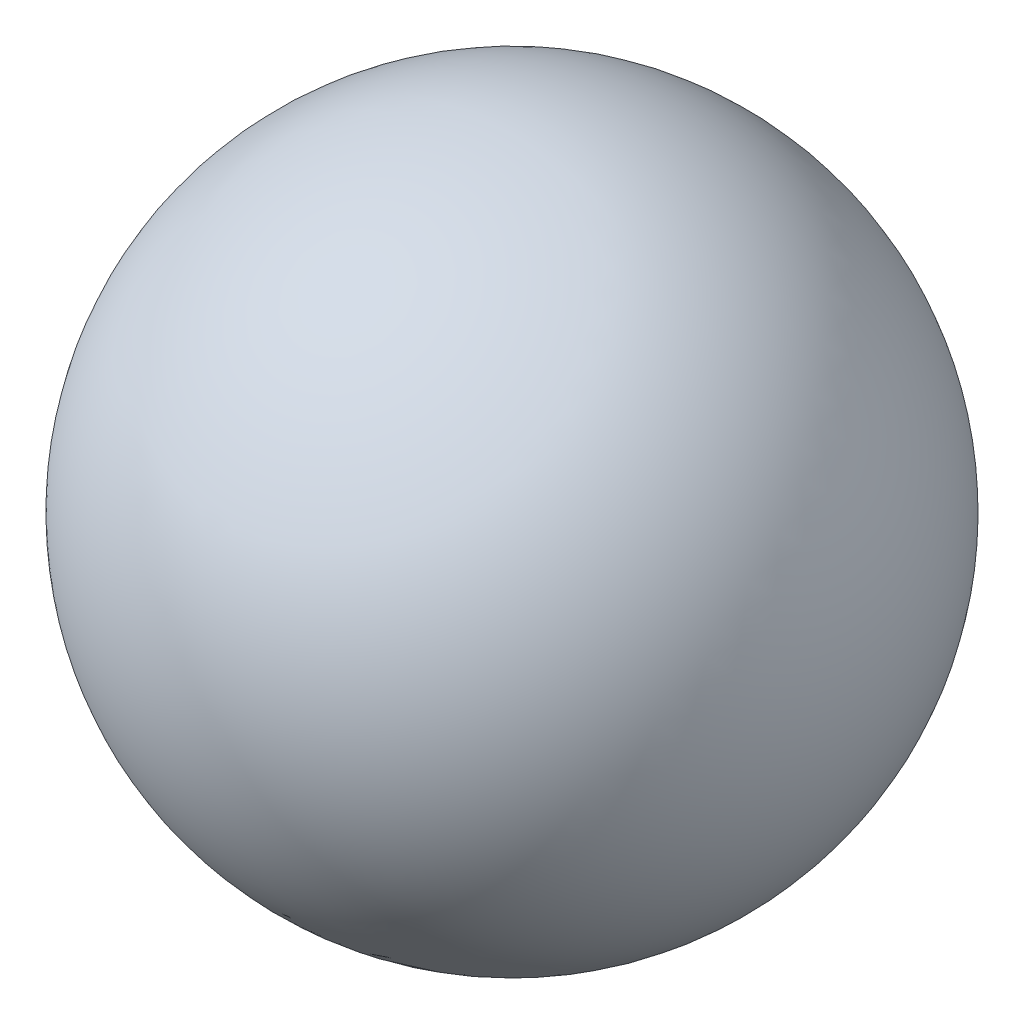
ISO-10303-21;
HEADER;
FILE_DESCRIPTION(('STEP AP214'),'2;1');
FILE_NAME('part.step','',(''),(''),'','','');
FILE_SCHEMA(('AUTOMOTIVE_DESIGN { 1 0 10303 214 1 1 1 1 }'));
ENDSEC;
DATA;
#1=APPLICATION_CONTEXT('core data for automotive mechanical design processes');
#2=APPLICATION_PROTOCOL_DEFINITION('international standard','automotive_design',2000,#1);
#3=PRODUCT_CONTEXT('',#1,'mechanical');
#4=PRODUCT('Part','Part','',(#3));
#5=PRODUCT_RELATED_PRODUCT_CATEGORY('part','',(#4));
#6=PRODUCT_DEFINITION_FORMATION('','',#4);
#7=PRODUCT_DEFINITION_CONTEXT('part definition',#1,'design');
#8=PRODUCT_DEFINITION('design','',#6,#7);
#9=PRODUCT_DEFINITION_SHAPE('','',#8);
#10=(LENGTH_UNIT() NAMED_UNIT(*) SI_UNIT(.MILLI.,.METRE.));
#11=(NAMED_UNIT(*) PLANE_ANGLE_UNIT() SI_UNIT($,.RADIAN.));
#12=(NAMED_UNIT(*) SI_UNIT($,.STERADIAN.) SOLID_ANGLE_UNIT());
#13=UNCERTAINTY_MEASURE_WITH_UNIT(LENGTH_MEASURE(1.E-05),#10,'distance_accuracy_value','');
#14=(GEOMETRIC_REPRESENTATION_CONTEXT(3) GLOBAL_UNCERTAINTY_ASSIGNED_CONTEXT((#13)) GLOBAL_UNIT_ASSIGNED_CONTEXT((#10,
#11,#12)) REPRESENTATION_CONTEXT('',''));
#15=CARTESIAN_POINT('',(0.,0.,0.));
#16=DIRECTION('',(0.,0.,1.));
#17=DIRECTION('',(1.,0.,0.));
#18=AXIS2_PLACEMENT_3D('',#15,#16,#17);
#19=CARTESIAN_POINT('',(49.75,20.6900424865634,48.794150696105));
#20=DIRECTION('',(0.,0.390381842971411,0.920653038162719));
#21=DIRECTION('',(0.173648177666934,-0.906666249816889,0.38445106559344));
#22=AXIS2_PLACEMENT_3D('',#19,#20,#21);
#23=SPHERICAL_SURFACE('',#22,5.95);
#24=CARTESIAN_POINT('',(49.75,23.0128144522433,54.2720362731732));
#25=VERTEX_POINT('',#24);
#26=VERTEX_LOOP('',#25);
#27=FACE_BOUND('',#26,.T.);
#28=CARTESIAN_POINT('',(49.75,18.3672705208835,43.3162651190368));
#29=VERTEX_POINT('',#28);
#30=VERTEX_LOOP('',#29);
#31=FACE_BOUND('',#30,.T.);
#32=ADVANCED_FACE('F16',(#27,#31),#23,.T.);
#33=CLOSED_SHELL('',(#32));
#34=MANIFOLD_SOLID_BREP('B1',#33);
#35=ADVANCED_BREP_SHAPE_REPRESENTATION('',(#18,#34),#14);
#36=SHAPE_DEFINITION_REPRESENTATION(#9,#35);
ENDSEC;
END-ISO-10303-21;
